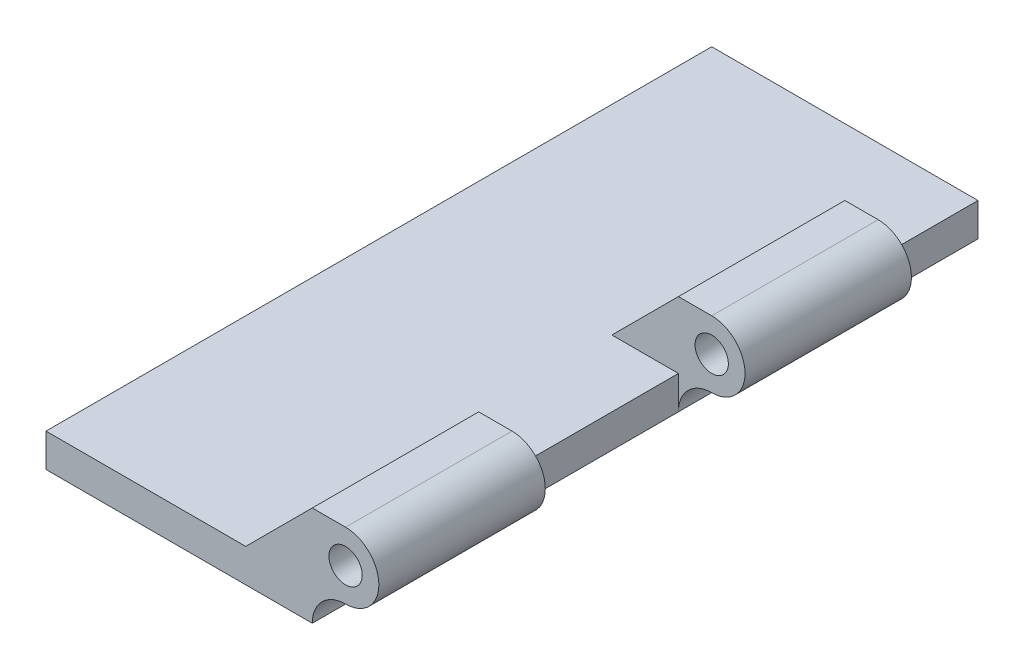
ISO-10303-21;
HEADER;
FILE_DESCRIPTION(('STEP AP214'),'2;1');
FILE_NAME('part.step','',(''),(''),'','','');
FILE_SCHEMA(('AUTOMOTIVE_DESIGN { 1 0 10303 214 1 1 1 1 }'));
ENDSEC;
DATA;
#1=APPLICATION_CONTEXT('core data for automotive mechanical design processes');
#2=APPLICATION_PROTOCOL_DEFINITION('international standard','automotive_design',2000,#1);
#3=PRODUCT_CONTEXT('',#1,'mechanical');
#4=PRODUCT('Part','Part','',(#3));
#5=PRODUCT_RELATED_PRODUCT_CATEGORY('part','',(#4));
#6=PRODUCT_DEFINITION_FORMATION('','',#4);
#7=PRODUCT_DEFINITION_CONTEXT('part definition',#1,'design');
#8=PRODUCT_DEFINITION('design','',#6,#7);
#9=PRODUCT_DEFINITION_SHAPE('','',#8);
#10=(LENGTH_UNIT() NAMED_UNIT(*) SI_UNIT(.MILLI.,.METRE.));
#11=(NAMED_UNIT(*) PLANE_ANGLE_UNIT() SI_UNIT($,.RADIAN.));
#12=(NAMED_UNIT(*) SI_UNIT($,.STERADIAN.) SOLID_ANGLE_UNIT());
#13=UNCERTAINTY_MEASURE_WITH_UNIT(LENGTH_MEASURE(1.E-05),#10,'distance_accuracy_value','');
#14=(GEOMETRIC_REPRESENTATION_CONTEXT(3) GLOBAL_UNCERTAINTY_ASSIGNED_CONTEXT((#13)) GLOBAL_UNIT_ASSIGNED_CONTEXT((#10,
#11,#12)) REPRESENTATION_CONTEXT('',''));
#15=CARTESIAN_POINT('',(0.,0.,0.));
#16=DIRECTION('',(0.,0.,1.));
#17=DIRECTION('',(1.,0.,0.));
#18=AXIS2_PLACEMENT_3D('',#15,#16,#17);
#19=CARTESIAN_POINT('',(8.,1.,0.));
#20=DIRECTION('',(-1.,0.,0.));
#21=DIRECTION('',(0.,0.,1.));
#22=AXIS2_PLACEMENT_3D('',#19,#20,#21);
#23=PLANE('',#22);
#24=DIRECTION('',(0.,0.,-1.));
#25=VECTOR('',#24,1.);
#26=CARTESIAN_POINT('',(8.,1.,0.));
#27=LINE('',#26,#25);
#28=CARTESIAN_POINT('',(8.,1.,-16.));
#29=VERTEX_POINT('',#28);
#30=CARTESIAN_POINT('',(8.,1.,-20.));
#31=VERTEX_POINT('',#30);
#32=EDGE_CURVE('E261',#29,#31,#27,.T.);
#33=ORIENTED_EDGE('',*,*,#32,.F.);
#34=DIRECTION('',(0.,-1.,0.));
#35=VECTOR('',#34,1.);
#36=CARTESIAN_POINT('',(8.,2.,-16.));
#37=LINE('',#36,#35);
#38=CARTESIAN_POINT('',(8.,0.,-16.));
#39=VERTEX_POINT('',#38);
#40=EDGE_CURVE('E59',#29,#39,#37,.T.);
#41=ORIENTED_EDGE('',*,*,#40,.T.);
#42=DIRECTION('',(0.,0.,-1.));
#43=VECTOR('',#42,1.);
#44=CARTESIAN_POINT('',(8.,0.,0.));
#45=LINE('',#44,#43);
#46=CARTESIAN_POINT('',(8.,0.,-20.));
#47=VERTEX_POINT('',#46);
#48=EDGE_CURVE('E276',#39,#47,#45,.T.);
#49=ORIENTED_EDGE('',*,*,#48,.T.);
#50=DIRECTION('',(0.,-1.,0.));
#51=VECTOR('',#50,1.);
#52=CARTESIAN_POINT('',(8.,1.,-20.));
#53=LINE('',#52,#51);
#54=EDGE_CURVE('E287',#31,#47,#53,.T.);
#55=ORIENTED_EDGE('',*,*,#54,.F.);
#56=EDGE_LOOP('',(#33,#41,#49,#55));
#57=FACE_BOUND('',#56,.T.);
#58=ADVANCED_FACE('F43',(#57),#23,.F.);
#59=CARTESIAN_POINT('',(0.,1.,0.));
#60=DIRECTION('',(0.,-1.,0.));
#61=DIRECTION('',(0.,0.,-1.));
#62=AXIS2_PLACEMENT_3D('',#59,#60,#61);
#63=PLANE('',#62);
#64=DIRECTION('',(1.,0.,0.));
#65=VECTOR('',#64,1.);
#66=CARTESIAN_POINT('',(8.,1.,-16.));
#67=LINE('',#66,#65);
#68=CARTESIAN_POINT('',(5.99999999999998,1.,-16.));
#69=VERTEX_POINT('',#68);
#70=EDGE_CURVE('E167',#69,#29,#67,.T.);
#71=ORIENTED_EDGE('',*,*,#70,.T.);
#72=ORIENTED_EDGE('',*,*,#32,.T.);
#73=DIRECTION('',(-1.,0.,0.));
#74=VECTOR('',#73,1.);
#75=CARTESIAN_POINT('',(0.,1.,-20.));
#76=LINE('',#75,#74);
#77=CARTESIAN_POINT('',(0.,1.,-20.));
#78=VERTEX_POINT('',#77);
#79=EDGE_CURVE('E266',#31,#78,#76,.T.);
#80=ORIENTED_EDGE('',*,*,#79,.T.);
#81=DIRECTION('',(0.,0.,1.));
#82=VECTOR('',#81,1.);
#83=CARTESIAN_POINT('',(0.,1.,0.));
#84=LINE('',#83,#82);
#85=CARTESIAN_POINT('',(0.,1.,0.));
#86=VERTEX_POINT('',#85);
#87=EDGE_CURVE('E253',#78,#86,#84,.T.);
#88=ORIENTED_EDGE('',*,*,#87,.T.);
#89=DIRECTION('',(1.,0.,0.));
#90=VECTOR('',#89,1.);
#91=CARTESIAN_POINT('',(0.,1.,0.));
#92=LINE('',#91,#90);
#93=CARTESIAN_POINT('',(5.99999999999998,1.,0.));
#94=VERTEX_POINT('',#93);
#95=EDGE_CURVE('E257',#86,#94,#92,.T.);
#96=ORIENTED_EDGE('',*,*,#95,.T.);
#97=DIRECTION('',(0.,0.,1.));
#98=VECTOR('',#97,1.);
#99=CARTESIAN_POINT('',(5.99999999999998,1.,-5.));
#100=LINE('',#99,#98);
#101=CARTESIAN_POINT('',(5.99999999999998,1.,-5.));
#102=VERTEX_POINT('',#101);
#103=EDGE_CURVE('E239',#102,#94,#100,.T.);
#104=ORIENTED_EDGE('',*,*,#103,.F.);
#105=DIRECTION('',(1.,0.,0.));
#106=VECTOR('',#105,1.);
#107=CARTESIAN_POINT('',(8.,1.,-5.));
#108=LINE('',#107,#106);
#109=CARTESIAN_POINT('',(8.,1.,-5.));
#110=VERTEX_POINT('',#109);
#111=EDGE_CURVE('E211',#102,#110,#108,.T.);
#112=ORIENTED_EDGE('',*,*,#111,.T.);
#113=CARTESIAN_POINT('',(8.,1.,-11.));
#114=VERTEX_POINT('',#113);
#115=EDGE_CURVE('E262',#110,#114,#27,.T.);
#116=ORIENTED_EDGE('',*,*,#115,.T.);
#117=DIRECTION('',(1.,0.,0.));
#118=VECTOR('',#117,1.);
#119=CARTESIAN_POINT('',(8.,1.,-11.));
#120=LINE('',#119,#118);
#121=CARTESIAN_POINT('',(5.99999999999998,1.,-11.));
#122=VERTEX_POINT('',#121);
#123=EDGE_CURVE('E180',#122,#114,#120,.T.);
#124=ORIENTED_EDGE('',*,*,#123,.F.);
#125=DIRECTION('',(0.,0.,1.));
#126=VECTOR('',#125,1.);
#127=CARTESIAN_POINT('',(5.99999999999998,1.,-16.));
#128=LINE('',#127,#126);
#129=EDGE_CURVE('E193',#69,#122,#128,.T.);
#130=ORIENTED_EDGE('',*,*,#129,.F.);
#131=EDGE_LOOP('',(#71,#72,#80,#88,#96,#104,#112,#116,#124,#130));
#132=FACE_BOUND('',#131,.T.);
#133=ADVANCED_FACE('F331',(#132),#63,.F.);
#134=CARTESIAN_POINT('',(0.,1.,0.));
#135=DIRECTION('',(1.,0.,0.));
#136=DIRECTION('',(0.,0.,-1.));
#137=AXIS2_PLACEMENT_3D('',#134,#135,#136);
#138=PLANE('',#137);
#139=DIRECTION('',(0.,0.,1.));
#140=VECTOR('',#139,1.);
#141=CARTESIAN_POINT('',(0.,0.,0.));
#142=LINE('',#141,#140);
#143=CARTESIAN_POINT('',(0.,0.,-20.));
#144=VERTEX_POINT('',#143);
#145=CARTESIAN_POINT('',(0.,0.,0.));
#146=VERTEX_POINT('',#145);
#147=EDGE_CURVE('E243',#144,#146,#142,.T.);
#148=ORIENTED_EDGE('',*,*,#147,.T.);
#149=DIRECTION('',(0.,-1.,0.));
#150=VECTOR('',#149,1.);
#151=CARTESIAN_POINT('',(0.,1.,0.));
#152=LINE('',#151,#150);
#153=EDGE_CURVE('E291',#86,#146,#152,.T.);
#154=ORIENTED_EDGE('',*,*,#153,.F.);
#155=ORIENTED_EDGE('',*,*,#87,.F.);
#156=DIRECTION('',(0.,-1.,0.));
#157=VECTOR('',#156,1.);
#158=CARTESIAN_POINT('',(0.,1.,-20.));
#159=LINE('',#158,#157);
#160=EDGE_CURVE('E269',#78,#144,#159,.T.);
#161=ORIENTED_EDGE('',*,*,#160,.T.);
#162=EDGE_LOOP('',(#148,#154,#155,#161));
#163=FACE_BOUND('',#162,.T.);
#164=ADVANCED_FACE('F357',(#163),#138,.F.);
#165=CARTESIAN_POINT('',(0.,1.,0.));
#166=DIRECTION('',(0.,0.,-1.));
#167=DIRECTION('',(-1.,0.,0.));
#168=AXIS2_PLACEMENT_3D('',#165,#166,#167);
#169=PLANE('',#168);
#170=DIRECTION('',(1.,0.,0.));
#171=VECTOR('',#170,1.);
#172=CARTESIAN_POINT('',(0.,0.,0.));
#173=LINE('',#172,#171);
#174=CARTESIAN_POINT('',(8.,0.,0.));
#175=VERTEX_POINT('',#174);
#176=EDGE_CURVE('E273',#146,#175,#173,.T.);
#177=ORIENTED_EDGE('',*,*,#176,.T.);
#178=CARTESIAN_POINT('',(9.,0.,0.));
#179=DIRECTION('',(0.,0.,-1.));
#180=DIRECTION('',(-1.,0.,0.));
#181=AXIS2_PLACEMENT_3D('',#178,#179,#180);
#182=CIRCLE('',#181,1.);
#183=CARTESIAN_POINT('',(9.,1.,0.));
#184=VERTEX_POINT('',#183);
#185=EDGE_CURVE('E302',#175,#184,#182,.T.);
#186=ORIENTED_EDGE('',*,*,#185,.T.);
#187=CARTESIAN_POINT('',(9.,2.,0.));
#188=DIRECTION('',(0.,0.,1.));
#189=DIRECTION('',(1.,0.,0.));
#190=AXIS2_PLACEMENT_3D('',#187,#188,#189);
#191=CIRCLE('',#190,1.);
#192=CARTESIAN_POINT('',(9.,3.,0.));
#193=VERTEX_POINT('',#192);
#194=EDGE_CURVE('E207',#184,#193,#191,.T.);
#195=ORIENTED_EDGE('',*,*,#194,.T.);
#196=DIRECTION('',(-1.,0.,0.));
#197=VECTOR('',#196,1.);
#198=CARTESIAN_POINT('',(9.,3.,0.));
#199=LINE('',#198,#197);
#200=CARTESIAN_POINT('',(8.,3.,0.));
#201=VERTEX_POINT('',#200);
#202=EDGE_CURVE('E232',#193,#201,#199,.T.);
#203=ORIENTED_EDGE('',*,*,#202,.T.);
#204=DIRECTION('',(-0.707106781186551,-0.707106781186544,0.));
#205=VECTOR('',#204,1.);
#206=CARTESIAN_POINT('',(8.,3.,0.));
#207=LINE('',#206,#205);
#208=EDGE_CURVE('E216',#201,#94,#207,.T.);
#209=ORIENTED_EDGE('',*,*,#208,.T.);
#210=ORIENTED_EDGE('',*,*,#95,.F.);
#211=ORIENTED_EDGE('',*,*,#153,.T.);
#212=EDGE_LOOP('',(#177,#186,#195,#203,#209,#210,#211));
#213=FACE_BOUND('',#212,.T.);
#214=CARTESIAN_POINT('',(9.,2.,0.));
#215=DIRECTION('',(0.,0.,1.));
#216=DIRECTION('',(1.,0.,0.));
#217=AXIS2_PLACEMENT_3D('',#214,#215,#216);
#218=CIRCLE('',#217,0.500000000000001);
#219=CARTESIAN_POINT('',(9.5,2.,0.));
#220=VERTEX_POINT('',#219);
#221=EDGE_CURVE('E197',#220,#220,#218,.T.);
#222=ORIENTED_EDGE('',*,*,#221,.F.);
#223=EDGE_LOOP('',(#222));
#224=FACE_BOUND('',#223,.T.);
#225=ADVANCED_FACE('F353',(#213,#224),#169,.F.);
#226=CARTESIAN_POINT('',(8.,0.,-5.));
#227=VERTEX_POINT('',#226);
#228=CARTESIAN_POINT('',(8.,0.,-11.));
#229=VERTEX_POINT('',#228);
#230=EDGE_CURVE('E281',#227,#229,#45,.T.);
#231=ORIENTED_EDGE('',*,*,#230,.T.);
#232=DIRECTION('',(0.,1.,0.));
#233=VECTOR('',#232,1.);
#234=CARTESIAN_POINT('',(8.,1.,-11.));
#235=LINE('',#234,#233);
#236=EDGE_CURVE('E305',#229,#114,#235,.T.);
#237=ORIENTED_EDGE('',*,*,#236,.T.);
#238=ORIENTED_EDGE('',*,*,#115,.F.);
#239=DIRECTION('',(0.,-1.,0.));
#240=VECTOR('',#239,1.);
#241=CARTESIAN_POINT('',(8.,2.,-5.));
#242=LINE('',#241,#240);
#243=EDGE_CURVE('E295',#110,#227,#242,.T.);
#244=ORIENTED_EDGE('',*,*,#243,.T.);
#245=EDGE_LOOP('',(#231,#237,#238,#244));
#246=FACE_BOUND('',#245,.T.);
#247=ADVANCED_FACE('F322',(#246),#23,.F.);
#248=CARTESIAN_POINT('',(0.,1.,-20.));
#249=DIRECTION('',(0.,0.,1.));
#250=DIRECTION('',(1.,0.,0.));
#251=AXIS2_PLACEMENT_3D('',#248,#249,#250);
#252=PLANE('',#251);
#253=DIRECTION('',(-1.,0.,0.));
#254=VECTOR('',#253,1.);
#255=CARTESIAN_POINT('',(0.,0.,-20.));
#256=LINE('',#255,#254);
#257=EDGE_CURVE('E258',#47,#144,#256,.T.);
#258=ORIENTED_EDGE('',*,*,#257,.T.);
#259=ORIENTED_EDGE('',*,*,#160,.F.);
#260=ORIENTED_EDGE('',*,*,#79,.F.);
#261=ORIENTED_EDGE('',*,*,#54,.T.);
#262=EDGE_LOOP('',(#258,#259,#260,#261));
#263=FACE_BOUND('',#262,.T.);
#264=ADVANCED_FACE('F361',(#263),#252,.F.);
#265=CARTESIAN_POINT('',(0.,0.,0.));
#266=DIRECTION('',(0.,-1.,0.));
#267=DIRECTION('',(0.,0.,-1.));
#268=AXIS2_PLACEMENT_3D('',#265,#266,#267);
#269=PLANE('',#268);
#270=ORIENTED_EDGE('',*,*,#147,.F.);
#271=ORIENTED_EDGE('',*,*,#257,.F.);
#272=ORIENTED_EDGE('',*,*,#48,.F.);
#273=EDGE_CURVE('E148',#229,#39,#45,.T.);
#274=ORIENTED_EDGE('',*,*,#273,.F.);
#275=ORIENTED_EDGE('',*,*,#230,.F.);
#276=EDGE_CURVE('E277',#175,#227,#45,.T.);
#277=ORIENTED_EDGE('',*,*,#276,.F.);
#278=ORIENTED_EDGE('',*,*,#176,.F.);
#279=EDGE_LOOP('',(#270,#271,#272,#274,#275,#277,#278));
#280=FACE_BOUND('',#279,.T.);
#281=ADVANCED_FACE('F315',(#280),#269,.T.);
#282=CARTESIAN_POINT('',(8.,3.,-5.));
#283=DIRECTION('',(-0.707106781186544,0.707106781186551,0.));
#284=DIRECTION('',(-0.707106781186551,-0.707106781186544,0.));
#285=AXIS2_PLACEMENT_3D('',#282,#283,#284);
#286=PLANE('',#285);
#287=ORIENTED_EDGE('',*,*,#208,.F.);
#288=DIRECTION('',(0.,0.,1.));
#289=VECTOR('',#288,1.);
#290=CARTESIAN_POINT('',(8.,3.,-5.));
#291=LINE('',#290,#289);
#292=CARTESIAN_POINT('',(8.,3.,-5.));
#293=VERTEX_POINT('',#292);
#294=EDGE_CURVE('E244',#293,#201,#291,.T.);
#295=ORIENTED_EDGE('',*,*,#294,.F.);
#296=DIRECTION('',(-0.707106781186551,-0.707106781186544,0.));
#297=VECTOR('',#296,1.);
#298=CARTESIAN_POINT('',(8.,3.,-5.));
#299=LINE('',#298,#297);
#300=EDGE_CURVE('E224',#293,#102,#299,.T.);
#301=ORIENTED_EDGE('',*,*,#300,.T.);
#302=ORIENTED_EDGE('',*,*,#103,.T.);
#303=EDGE_LOOP('',(#287,#295,#301,#302));
#304=FACE_BOUND('',#303,.T.);
#305=ADVANCED_FACE('F339',(#304),#286,.T.);
#306=CARTESIAN_POINT('',(9.,3.,-5.));
#307=DIRECTION('',(0.,1.,0.));
#308=DIRECTION('',(0.,0.,1.));
#309=AXIS2_PLACEMENT_3D('',#306,#307,#308);
#310=PLANE('',#309);
#311=ORIENTED_EDGE('',*,*,#202,.F.);
#312=DIRECTION('',(0.,0.,1.));
#313=VECTOR('',#312,1.);
#314=CARTESIAN_POINT('',(9.,3.,-5.));
#315=LINE('',#314,#313);
#316=CARTESIAN_POINT('',(9.,3.,-5.));
#317=VERTEX_POINT('',#316);
#318=EDGE_CURVE('E247',#317,#193,#315,.T.);
#319=ORIENTED_EDGE('',*,*,#318,.F.);
#320=DIRECTION('',(-1.,0.,0.));
#321=VECTOR('',#320,1.);
#322=CARTESIAN_POINT('',(9.,3.,-5.));
#323=LINE('',#322,#321);
#324=EDGE_CURVE('E220',#317,#293,#323,.T.);
#325=ORIENTED_EDGE('',*,*,#324,.T.);
#326=ORIENTED_EDGE('',*,*,#294,.T.);
#327=EDGE_LOOP('',(#311,#319,#325,#326));
#328=FACE_BOUND('',#327,.T.);
#329=ADVANCED_FACE('F342',(#328),#310,.T.);
#330=CARTESIAN_POINT('',(9.,2.,-5.));
#331=DIRECTION('',(0.,0.,1.));
#332=DIRECTION('',(1.,0.,0.));
#333=AXIS2_PLACEMENT_3D('',#330,#331,#332);
#334=CYLINDRICAL_SURFACE('',#333,1.);
#335=ORIENTED_EDGE('',*,*,#194,.F.);
#336=DIRECTION('',(0.,0.,1.));
#337=VECTOR('',#336,1.);
#338=CARTESIAN_POINT('',(9.,1.,-5.));
#339=LINE('',#338,#337);
#340=CARTESIAN_POINT('',(9.,1.,-5.));
#341=VERTEX_POINT('',#340);
#342=EDGE_CURVE('E228',#341,#184,#339,.T.);
#343=ORIENTED_EDGE('',*,*,#342,.F.);
#344=CARTESIAN_POINT('',(9.,2.,-5.));
#345=DIRECTION('',(0.,0.,1.));
#346=DIRECTION('',(1.,0.,0.));
#347=AXIS2_PLACEMENT_3D('',#344,#345,#346);
#348=CIRCLE('',#347,1.);
#349=EDGE_CURVE('E215',#341,#317,#348,.T.);
#350=ORIENTED_EDGE('',*,*,#349,.T.);
#351=ORIENTED_EDGE('',*,*,#318,.T.);
#352=EDGE_LOOP('',(#335,#343,#350,#351));
#353=FACE_BOUND('',#352,.T.);
#354=ADVANCED_FACE('F347',(#353),#334,.T.);
#355=CARTESIAN_POINT('',(9.,2.,-5.));
#356=DIRECTION('',(0.,0.,1.));
#357=DIRECTION('',(1.,0.,0.));
#358=AXIS2_PLACEMENT_3D('',#355,#356,#357);
#359=PLANE('',#358);
#360=CARTESIAN_POINT('',(9.,2.,-5.));
#361=DIRECTION('',(0.,0.,1.));
#362=DIRECTION('',(1.,0.,0.));
#363=AXIS2_PLACEMENT_3D('',#360,#361,#362);
#364=CIRCLE('',#363,0.500000000000001);
#365=CARTESIAN_POINT('',(9.5,2.,-5.));
#366=VERTEX_POINT('',#365);
#367=EDGE_CURVE('E203',#366,#366,#364,.T.);
#368=ORIENTED_EDGE('',*,*,#367,.T.);
#369=EDGE_LOOP('',(#368));
#370=FACE_BOUND('',#369,.T.);
#371=ORIENTED_EDGE('',*,*,#111,.F.);
#372=ORIENTED_EDGE('',*,*,#300,.F.);
#373=ORIENTED_EDGE('',*,*,#324,.F.);
#374=ORIENTED_EDGE('',*,*,#349,.F.);
#375=CARTESIAN_POINT('',(9.,0.,-5.));
#376=DIRECTION('',(0.,0.,1.));
#377=DIRECTION('',(1.,0.,0.));
#378=AXIS2_PLACEMENT_3D('',#375,#376,#377);
#379=CIRCLE('',#378,1.);
#380=EDGE_CURVE('E299',#341,#227,#379,.T.);
#381=ORIENTED_EDGE('',*,*,#380,.T.);
#382=ORIENTED_EDGE('',*,*,#243,.F.);
#383=EDGE_LOOP('',(#371,#372,#373,#374,#381,#382));
#384=FACE_BOUND('',#383,.T.);
#385=ADVANCED_FACE('F335',(#370,#384),#359,.F.);
#386=CARTESIAN_POINT('',(9.,2.,-5.));
#387=DIRECTION('',(0.,0.,1.));
#388=DIRECTION('',(1.,0.,0.));
#389=AXIS2_PLACEMENT_3D('',#386,#387,#388);
#390=CYLINDRICAL_SURFACE('',#389,0.500000000000001);
#391=ORIENTED_EDGE('',*,*,#367,.F.);
#392=EDGE_LOOP('',(#391));
#393=FACE_BOUND('',#392,.T.);
#394=ORIENTED_EDGE('',*,*,#221,.T.);
#395=EDGE_LOOP('',(#394));
#396=FACE_BOUND('',#395,.T.);
#397=ADVANCED_FACE('F394',(#393,#396),#390,.F.);
#398=CARTESIAN_POINT('',(9.,0.,-5.));
#399=DIRECTION('',(0.,0.,-1.));
#400=DIRECTION('',(-1.,0.,0.));
#401=AXIS2_PLACEMENT_3D('',#398,#399,#400);
#402=CYLINDRICAL_SURFACE('',#401,1.);
#403=ORIENTED_EDGE('',*,*,#185,.F.);
#404=ORIENTED_EDGE('',*,*,#276,.T.);
#405=ORIENTED_EDGE('',*,*,#380,.F.);
#406=ORIENTED_EDGE('',*,*,#342,.T.);
#407=EDGE_LOOP('',(#403,#404,#405,#406));
#408=FACE_BOUND('',#407,.T.);
#409=ADVANCED_FACE('F350',(#408),#402,.F.);
#410=CARTESIAN_POINT('',(8.,3.,-16.));
#411=DIRECTION('',(-0.707106781186544,0.707106781186551,0.));
#412=DIRECTION('',(-0.707106781186551,-0.707106781186544,0.));
#413=AXIS2_PLACEMENT_3D('',#410,#411,#412);
#414=PLANE('',#413);
#415=DIRECTION('',(-0.707106781186551,-0.707106781186544,0.));
#416=VECTOR('',#415,1.);
#417=CARTESIAN_POINT('',(8.,3.,-11.));
#418=LINE('',#417,#416);
#419=CARTESIAN_POINT('',(8.,3.,-11.));
#420=VERTEX_POINT('',#419);
#421=EDGE_CURVE('E173',#420,#122,#418,.T.);
#422=ORIENTED_EDGE('',*,*,#421,.F.);
#423=DIRECTION('',(0.,0.,1.));
#424=VECTOR('',#423,1.);
#425=CARTESIAN_POINT('',(8.,3.,-16.));
#426=LINE('',#425,#424);
#427=CARTESIAN_POINT('',(8.,3.,-16.));
#428=VERTEX_POINT('',#427);
#429=EDGE_CURVE('E198',#428,#420,#426,.T.);
#430=ORIENTED_EDGE('',*,*,#429,.F.);
#431=DIRECTION('',(-0.707106781186551,-0.707106781186544,0.));
#432=VECTOR('',#431,1.);
#433=CARTESIAN_POINT('',(8.,3.,-16.));
#434=LINE('',#433,#432);
#435=EDGE_CURVE('E159',#428,#69,#434,.T.);
#436=ORIENTED_EDGE('',*,*,#435,.T.);
#437=ORIENTED_EDGE('',*,*,#129,.T.);
#438=EDGE_LOOP('',(#422,#430,#436,#437));
#439=FACE_BOUND('',#438,.T.);
#440=ADVANCED_FACE('F364',(#439),#414,.T.);
#441=CARTESIAN_POINT('',(9.,3.,-16.));
#442=DIRECTION('',(0.,1.,0.));
#443=DIRECTION('',(0.,0.,1.));
#444=AXIS2_PLACEMENT_3D('',#441,#442,#443);
#445=PLANE('',#444);
#446=DIRECTION('',(-1.,0.,0.));
#447=VECTOR('',#446,1.);
#448=CARTESIAN_POINT('',(9.,3.,-11.));
#449=LINE('',#448,#447);
#450=CARTESIAN_POINT('',(9.,3.,-11.));
#451=VERTEX_POINT('',#450);
#452=EDGE_CURVE('E187',#451,#420,#449,.T.);
#453=ORIENTED_EDGE('',*,*,#452,.F.);
#454=DIRECTION('',(0.,0.,1.));
#455=VECTOR('',#454,1.);
#456=CARTESIAN_POINT('',(9.,3.,-16.));
#457=LINE('',#456,#455);
#458=CARTESIAN_POINT('',(9.,3.,-16.));
#459=VERTEX_POINT('',#458);
#460=EDGE_CURVE('E158',#459,#451,#457,.T.);
#461=ORIENTED_EDGE('',*,*,#460,.F.);
#462=DIRECTION('',(-1.,0.,0.));
#463=VECTOR('',#462,1.);
#464=CARTESIAN_POINT('',(9.,3.,-16.));
#465=LINE('',#464,#463);
#466=EDGE_CURVE('E165',#459,#428,#465,.T.);
#467=ORIENTED_EDGE('',*,*,#466,.T.);
#468=ORIENTED_EDGE('',*,*,#429,.T.);
#469=EDGE_LOOP('',(#453,#461,#467,#468));
#470=FACE_BOUND('',#469,.T.);
#471=ADVANCED_FACE('F367',(#470),#445,.T.);
#472=CARTESIAN_POINT('',(9.,2.,-16.));
#473=DIRECTION('',(0.,0.,1.));
#474=DIRECTION('',(1.,0.,0.));
#475=AXIS2_PLACEMENT_3D('',#472,#473,#474);
#476=CYLINDRICAL_SURFACE('',#475,1.);
#477=CARTESIAN_POINT('',(9.,2.,-11.));
#478=DIRECTION('',(0.,0.,1.));
#479=DIRECTION('',(1.,0.,0.));
#480=AXIS2_PLACEMENT_3D('',#477,#478,#479);
#481=CIRCLE('',#480,1.);
#482=CARTESIAN_POINT('',(9.,1.,-11.));
#483=VERTEX_POINT('',#482);
#484=EDGE_CURVE('E156',#483,#451,#481,.T.);
#485=ORIENTED_EDGE('',*,*,#484,.F.);
#486=DIRECTION('',(0.,0.,1.));
#487=VECTOR('',#486,1.);
#488=CARTESIAN_POINT('',(9.,1.,-16.));
#489=LINE('',#488,#487);
#490=CARTESIAN_POINT('',(9.,1.,-16.));
#491=VERTEX_POINT('',#490);
#492=EDGE_CURVE('E146',#491,#483,#489,.T.);
#493=ORIENTED_EDGE('',*,*,#492,.F.);
#494=CARTESIAN_POINT('',(9.,2.,-16.));
#495=DIRECTION('',(0.,0.,1.));
#496=DIRECTION('',(1.,0.,0.));
#497=AXIS2_PLACEMENT_3D('',#494,#495,#496);
#498=CIRCLE('',#497,1.);
#499=EDGE_CURVE('E154',#491,#459,#498,.T.);
#500=ORIENTED_EDGE('',*,*,#499,.T.);
#501=ORIENTED_EDGE('',*,*,#460,.T.);
#502=EDGE_LOOP('',(#485,#493,#500,#501));
#503=FACE_BOUND('',#502,.T.);
#504=ADVANCED_FACE('F153',(#503),#476,.T.);
#505=CARTESIAN_POINT('',(9.,2.,-16.));
#506=DIRECTION('',(0.,0.,1.));
#507=DIRECTION('',(1.,0.,0.));
#508=AXIS2_PLACEMENT_3D('',#505,#506,#507);
#509=PLANE('',#508);
#510=CARTESIAN_POINT('',(9.,2.,-16.));
#511=DIRECTION('',(0.,0.,1.));
#512=DIRECTION('',(1.,0.,0.));
#513=AXIS2_PLACEMENT_3D('',#510,#511,#512);
#514=CIRCLE('',#513,0.500000000000001);
#515=CARTESIAN_POINT('',(9.5,2.,-16.));
#516=VERTEX_POINT('',#515);
#517=EDGE_CURVE('E184',#516,#516,#514,.T.);
#518=ORIENTED_EDGE('',*,*,#517,.T.);
#519=EDGE_LOOP('',(#518));
#520=FACE_BOUND('',#519,.T.);
#521=ORIENTED_EDGE('',*,*,#70,.F.);
#522=ORIENTED_EDGE('',*,*,#435,.F.);
#523=ORIENTED_EDGE('',*,*,#466,.F.);
#524=ORIENTED_EDGE('',*,*,#499,.F.);
#525=CARTESIAN_POINT('',(9.,0.,-16.));
#526=DIRECTION('',(0.,0.,1.));
#527=DIRECTION('',(1.,0.,0.));
#528=AXIS2_PLACEMENT_3D('',#525,#526,#527);
#529=CIRCLE('',#528,1.);
#530=EDGE_CURVE('E52',#491,#39,#529,.T.);
#531=ORIENTED_EDGE('',*,*,#530,.T.);
#532=ORIENTED_EDGE('',*,*,#40,.F.);
#533=EDGE_LOOP('',(#521,#522,#523,#524,#531,#532));
#534=FACE_BOUND('',#533,.T.);
#535=ADVANCED_FACE('F162',(#520,#534),#509,.F.);
#536=CARTESIAN_POINT('',(9.,2.,-11.));
#537=DIRECTION('',(0.,0.,1.));
#538=DIRECTION('',(1.,0.,0.));
#539=AXIS2_PLACEMENT_3D('',#536,#537,#538);
#540=PLANE('',#539);
#541=CARTESIAN_POINT('',(9.,2.,-11.));
#542=DIRECTION('',(0.,0.,1.));
#543=DIRECTION('',(1.,0.,0.));
#544=AXIS2_PLACEMENT_3D('',#541,#542,#543);
#545=CIRCLE('',#544,0.500000000000001);
#546=CARTESIAN_POINT('',(9.5,2.,-11.));
#547=VERTEX_POINT('',#546);
#548=EDGE_CURVE('E582',#547,#547,#545,.T.);
#549=ORIENTED_EDGE('',*,*,#548,.F.);
#550=EDGE_LOOP('',(#549));
#551=FACE_BOUND('',#550,.T.);
#552=ORIENTED_EDGE('',*,*,#421,.T.);
#553=ORIENTED_EDGE('',*,*,#123,.T.);
#554=ORIENTED_EDGE('',*,*,#236,.F.);
#555=CARTESIAN_POINT('',(9.,0.,-11.));
#556=DIRECTION('',(0.,0.,1.));
#557=DIRECTION('',(1.,0.,0.));
#558=AXIS2_PLACEMENT_3D('',#555,#556,#557);
#559=CIRCLE('',#558,1.);
#560=EDGE_CURVE('E11',#229,#483,#559,.F.);
#561=ORIENTED_EDGE('',*,*,#560,.T.);
#562=ORIENTED_EDGE('',*,*,#484,.T.);
#563=ORIENTED_EDGE('',*,*,#452,.T.);
#564=EDGE_LOOP('',(#552,#553,#554,#561,#562,#563));
#565=FACE_BOUND('',#564,.T.);
#566=ADVANCED_FACE('F326',(#551,#565),#540,.T.);
#567=CARTESIAN_POINT('',(9.,2.,-16.));
#568=DIRECTION('',(0.,0.,1.));
#569=DIRECTION('',(1.,0.,0.));
#570=AXIS2_PLACEMENT_3D('',#567,#568,#569);
#571=CYLINDRICAL_SURFACE('',#570,0.500000000000001);
#572=ORIENTED_EDGE('',*,*,#517,.F.);
#573=EDGE_LOOP('',(#572));
#574=FACE_BOUND('',#573,.T.);
#575=ORIENTED_EDGE('',*,*,#548,.T.);
#576=EDGE_LOOP('',(#575));
#577=FACE_BOUND('',#576,.T.);
#578=ADVANCED_FACE('F542',(#574,#577),#571,.F.);
#579=CARTESIAN_POINT('',(9.,0.,-16.));
#580=DIRECTION('',(0.,0.,-1.));
#581=DIRECTION('',(-1.,0.,0.));
#582=AXIS2_PLACEMENT_3D('',#579,#580,#581);
#583=CYLINDRICAL_SURFACE('',#582,1.);
#584=ORIENTED_EDGE('',*,*,#560,.F.);
#585=ORIENTED_EDGE('',*,*,#273,.T.);
#586=ORIENTED_EDGE('',*,*,#530,.F.);
#587=ORIENTED_EDGE('',*,*,#492,.T.);
#588=EDGE_LOOP('',(#584,#585,#586,#587));
#589=FACE_BOUND('',#588,.T.);
#590=ADVANCED_FACE('F45',(#589),#583,.F.);
#591=CLOSED_SHELL('',(#58,#133,#164,#225,#247,#264,#281,#305,#329,#354,#385,#397,#409,#440,#471,
#504,#535,#566,#578,#590));
#592=MANIFOLD_SOLID_BREP('B2',#591);
#593=ADVANCED_BREP_SHAPE_REPRESENTATION('',(#18,#592),#14);
#594=SHAPE_DEFINITION_REPRESENTATION(#9,#593);
ENDSEC;
END-ISO-10303-21;
